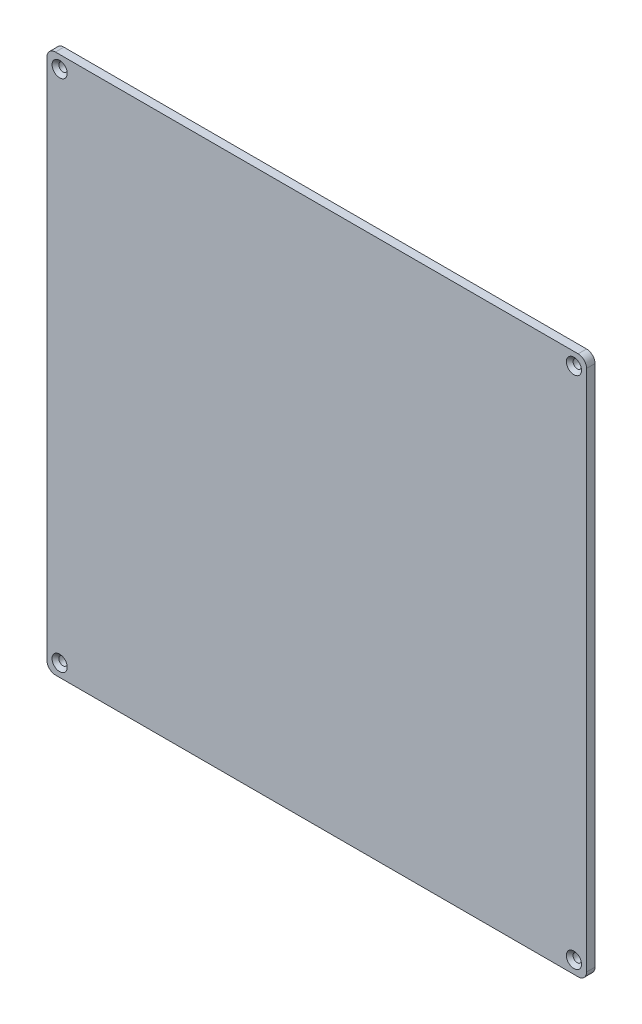
ISO-10303-21;
HEADER;
FILE_DESCRIPTION(('STEP AP214'),'2;1');
FILE_NAME('part.step','',(''),(''),'','','');
FILE_SCHEMA(('AUTOMOTIVE_DESIGN { 1 0 10303 214 1 1 1 1 }'));
ENDSEC;
DATA;
#1=APPLICATION_CONTEXT('core data for automotive mechanical design processes');
#2=APPLICATION_PROTOCOL_DEFINITION('international standard','automotive_design',2000,#1);
#3=PRODUCT_CONTEXT('',#1,'mechanical');
#4=PRODUCT('Part','Part','',(#3));
#5=PRODUCT_RELATED_PRODUCT_CATEGORY('part','',(#4));
#6=PRODUCT_DEFINITION_FORMATION('','',#4);
#7=PRODUCT_DEFINITION_CONTEXT('part definition',#1,'design');
#8=PRODUCT_DEFINITION('design','',#6,#7);
#9=PRODUCT_DEFINITION_SHAPE('','',#8);
#10=(LENGTH_UNIT() NAMED_UNIT(*) SI_UNIT(.MILLI.,.METRE.));
#11=(NAMED_UNIT(*) PLANE_ANGLE_UNIT() SI_UNIT($,.RADIAN.));
#12=(NAMED_UNIT(*) SI_UNIT($,.STERADIAN.) SOLID_ANGLE_UNIT());
#13=UNCERTAINTY_MEASURE_WITH_UNIT(LENGTH_MEASURE(1.E-05),#10,'distance_accuracy_value','');
#14=(GEOMETRIC_REPRESENTATION_CONTEXT(3) GLOBAL_UNCERTAINTY_ASSIGNED_CONTEXT((#13)) GLOBAL_UNIT_ASSIGNED_CONTEXT((#10,
#11,#12)) REPRESENTATION_CONTEXT('',''));
#15=CARTESIAN_POINT('',(0.,0.,0.));
#16=DIRECTION('',(0.,0.,1.));
#17=DIRECTION('',(1.,0.,0.));
#18=AXIS2_PLACEMENT_3D('',#15,#16,#17);
#19=CARTESIAN_POINT('',(0.,0.,5.));
#20=DIRECTION('',(0.,1.,0.));
#21=DIRECTION('',(0.,0.,1.));
#22=AXIS2_PLACEMENT_3D('',#19,#20,#21);
#23=PLANE('',#22);
#24=DIRECTION('',(1.,0.,0.));
#25=VECTOR('',#24,1.);
#26=CARTESIAN_POINT('',(0.,0.,5.));
#27=LINE('',#26,#25);
#28=CARTESIAN_POINT('',(5.,0.,5.));
#29=VERTEX_POINT('',#28);
#30=CARTESIAN_POINT('',(315.,0.,5.));
#31=VERTEX_POINT('',#30);
#32=EDGE_CURVE('E121',#29,#31,#27,.T.);
#33=ORIENTED_EDGE('',*,*,#32,.F.);
#34=DIRECTION('',(0.,0.,-1.));
#35=VECTOR('',#34,1.);
#36=CARTESIAN_POINT('',(5.,0.,0.));
#37=LINE('',#36,#35);
#38=CARTESIAN_POINT('',(5.,0.,0.));
#39=VERTEX_POINT('',#38);
#40=EDGE_CURVE('E106',#29,#39,#37,.T.);
#41=ORIENTED_EDGE('',*,*,#40,.T.);
#42=DIRECTION('',(1.,0.,0.));
#43=VECTOR('',#42,1.);
#44=CARTESIAN_POINT('',(0.,0.,0.));
#45=LINE('',#44,#43);
#46=CARTESIAN_POINT('',(315.,0.,0.));
#47=VERTEX_POINT('',#46);
#48=EDGE_CURVE('E118',#39,#47,#45,.T.);
#49=ORIENTED_EDGE('',*,*,#48,.T.);
#50=DIRECTION('',(0.,0.,-1.));
#51=VECTOR('',#50,1.);
#52=CARTESIAN_POINT('',(315.,0.,5.));
#53=LINE('',#52,#51);
#54=EDGE_CURVE('E123',#47,#31,#53,.F.);
#55=ORIENTED_EDGE('',*,*,#54,.T.);
#56=EDGE_LOOP('',(#33,#41,#49,#55));
#57=FACE_BOUND('',#56,.T.);
#58=ADVANCED_FACE('F35',(#57),#23,.F.);
#59=CARTESIAN_POINT('',(320.,0.,5.));
#60=DIRECTION('',(-1.,0.,0.));
#61=DIRECTION('',(0.,0.,1.));
#62=AXIS2_PLACEMENT_3D('',#59,#60,#61);
#63=PLANE('',#62);
#64=DIRECTION('',(0.,1.,0.));
#65=VECTOR('',#64,1.);
#66=CARTESIAN_POINT('',(320.,0.,5.));
#67=LINE('',#66,#65);
#68=CARTESIAN_POINT('',(320.,5.,5.));
#69=VERTEX_POINT('',#68);
#70=CARTESIAN_POINT('',(320.,315.,5.));
#71=VERTEX_POINT('',#70);
#72=EDGE_CURVE('E278',#69,#71,#67,.T.);
#73=ORIENTED_EDGE('',*,*,#72,.F.);
#74=DIRECTION('',(0.,0.,-1.));
#75=VECTOR('',#74,1.);
#76=CARTESIAN_POINT('',(320.,5.,5.));
#77=LINE('',#76,#75);
#78=CARTESIAN_POINT('',(320.,5.,0.));
#79=VERTEX_POINT('',#78);
#80=EDGE_CURVE('E164',#69,#79,#77,.T.);
#81=ORIENTED_EDGE('',*,*,#80,.T.);
#82=DIRECTION('',(0.,1.,0.));
#83=VECTOR('',#82,1.);
#84=CARTESIAN_POINT('',(320.,0.,0.));
#85=LINE('',#84,#83);
#86=CARTESIAN_POINT('',(320.,315.,0.));
#87=VERTEX_POINT('',#86);
#88=EDGE_CURVE('E128',#79,#87,#85,.T.);
#89=ORIENTED_EDGE('',*,*,#88,.T.);
#90=DIRECTION('',(0.,0.,-1.));
#91=VECTOR('',#90,1.);
#92=CARTESIAN_POINT('',(320.,315.,5.));
#93=LINE('',#92,#91);
#94=EDGE_CURVE('E162',#87,#71,#93,.F.);
#95=ORIENTED_EDGE('',*,*,#94,.T.);
#96=EDGE_LOOP('',(#73,#81,#89,#95));
#97=FACE_BOUND('',#96,.T.);
#98=ADVANCED_FACE('F208',(#97),#63,.F.);
#99=CARTESIAN_POINT('',(0.,320.,5.));
#100=DIRECTION('',(0.,1.,0.));
#101=DIRECTION('',(0.,0.,1.));
#102=AXIS2_PLACEMENT_3D('',#99,#100,#101);
#103=PLANE('',#102);
#104=DIRECTION('',(1.,0.,0.));
#105=VECTOR('',#104,1.);
#106=CARTESIAN_POINT('',(0.,320.,5.));
#107=LINE('',#106,#105);
#108=CARTESIAN_POINT('',(5.,320.,5.));
#109=VERTEX_POINT('',#108);
#110=CARTESIAN_POINT('',(315.,320.,5.));
#111=VERTEX_POINT('',#110);
#112=EDGE_CURVE('E275',#109,#111,#107,.T.);
#113=ORIENTED_EDGE('',*,*,#112,.T.);
#114=DIRECTION('',(0.,0.,-1.));
#115=VECTOR('',#114,1.);
#116=CARTESIAN_POINT('',(315.,320.,0.));
#117=LINE('',#116,#115);
#118=CARTESIAN_POINT('',(315.,320.,0.));
#119=VERTEX_POINT('',#118);
#120=EDGE_CURVE('E168',#111,#119,#117,.T.);
#121=ORIENTED_EDGE('',*,*,#120,.T.);
#122=DIRECTION('',(1.,0.,0.));
#123=VECTOR('',#122,1.);
#124=CARTESIAN_POINT('',(0.,320.,0.));
#125=LINE('',#124,#123);
#126=CARTESIAN_POINT('',(5.,320.,0.));
#127=VERTEX_POINT('',#126);
#128=EDGE_CURVE('E132',#127,#119,#125,.T.);
#129=ORIENTED_EDGE('',*,*,#128,.F.);
#130=DIRECTION('',(0.,0.,-1.));
#131=VECTOR('',#130,1.);
#132=CARTESIAN_POINT('',(5.,320.,5.));
#133=LINE('',#132,#131);
#134=EDGE_CURVE('E57',#127,#109,#133,.F.);
#135=ORIENTED_EDGE('',*,*,#134,.T.);
#136=EDGE_LOOP('',(#113,#121,#129,#135));
#137=FACE_BOUND('',#136,.T.);
#138=ADVANCED_FACE('F213',(#137),#103,.T.);
#139=CARTESIAN_POINT('',(0.,0.,5.));
#140=DIRECTION('',(-1.,0.,0.));
#141=DIRECTION('',(0.,0.,1.));
#142=AXIS2_PLACEMENT_3D('',#139,#140,#141);
#143=PLANE('',#142);
#144=DIRECTION('',(0.,1.,0.));
#145=VECTOR('',#144,1.);
#146=CARTESIAN_POINT('',(0.,0.,0.));
#147=LINE('',#146,#145);
#148=CARTESIAN_POINT('',(0.,5.,0.));
#149=VERTEX_POINT('',#148);
#150=CARTESIAN_POINT('',(0.,315.,0.));
#151=VERTEX_POINT('',#150);
#152=EDGE_CURVE('E141',#149,#151,#147,.T.);
#153=ORIENTED_EDGE('',*,*,#152,.F.);
#154=DIRECTION('',(0.,0.,-1.));
#155=VECTOR('',#154,1.);
#156=CARTESIAN_POINT('',(0.,5.,5.));
#157=LINE('',#156,#155);
#158=CARTESIAN_POINT('',(0.,5.,5.));
#159=VERTEX_POINT('',#158);
#160=EDGE_CURVE('E107',#149,#159,#157,.F.);
#161=ORIENTED_EDGE('',*,*,#160,.T.);
#162=DIRECTION('',(0.,1.,0.));
#163=VECTOR('',#162,1.);
#164=CARTESIAN_POINT('',(0.,0.,5.));
#165=LINE('',#164,#163);
#166=CARTESIAN_POINT('',(0.,315.,5.));
#167=VERTEX_POINT('',#166);
#168=EDGE_CURVE('E146',#159,#167,#165,.T.);
#169=ORIENTED_EDGE('',*,*,#168,.T.);
#170=DIRECTION('',(0.,0.,-1.));
#171=VECTOR('',#170,1.);
#172=CARTESIAN_POINT('',(0.,315.,5.));
#173=LINE('',#172,#171);
#174=EDGE_CURVE('E112',#167,#151,#173,.T.);
#175=ORIENTED_EDGE('',*,*,#174,.T.);
#176=EDGE_LOOP('',(#153,#161,#169,#175));
#177=FACE_BOUND('',#176,.T.);
#178=ADVANCED_FACE('F222',(#177),#143,.T.);
#179=CARTESIAN_POINT('',(7.5,312.5,5.));
#180=DIRECTION('',(0.,0.,-1.));
#181=DIRECTION('',(-1.,0.,0.));
#182=AXIS2_PLACEMENT_3D('',#179,#180,#181);
#183=CYLINDRICAL_SURFACE('',#182,2.5);
#184=CARTESIAN_POINT('',(7.5,312.5,2.99999999999999));
#185=DIRECTION('',(0.,0.,1.));
#186=DIRECTION('',(1.,0.,0.));
#187=AXIS2_PLACEMENT_3D('',#184,#185,#186);
#188=CIRCLE('',#187,2.5);
#189=CARTESIAN_POINT('',(10.,312.5,2.99999999999999));
#190=VERTEX_POINT('',#189);
#191=EDGE_CURVE('E171',#190,#190,#188,.T.);
#192=ORIENTED_EDGE('',*,*,#191,.T.);
#193=EDGE_LOOP('',(#192));
#194=FACE_BOUND('',#193,.T.);
#195=CARTESIAN_POINT('',(7.5,312.5,0.));
#196=DIRECTION('',(0.,0.,1.));
#197=DIRECTION('',(1.,0.,0.));
#198=AXIS2_PLACEMENT_3D('',#195,#196,#197);
#199=CIRCLE('',#198,2.5);
#200=CARTESIAN_POINT('',(10.,312.5,0.));
#201=VERTEX_POINT('',#200);
#202=EDGE_CURVE('E129',#201,#201,#199,.T.);
#203=ORIENTED_EDGE('',*,*,#202,.F.);
#204=EDGE_LOOP('',(#203));
#205=FACE_BOUND('',#204,.T.);
#206=ADVANCED_FACE('F218',(#194,#205),#183,.F.);
#207=CARTESIAN_POINT('',(312.5,312.5,5.));
#208=DIRECTION('',(0.,0.,-1.));
#209=DIRECTION('',(-1.,0.,0.));
#210=AXIS2_PLACEMENT_3D('',#207,#208,#209);
#211=CYLINDRICAL_SURFACE('',#210,2.50000000000002);
#212=CARTESIAN_POINT('',(312.5,312.5,2.99999999999995));
#213=DIRECTION('',(0.,0.,1.));
#214=DIRECTION('',(1.,0.,0.));
#215=AXIS2_PLACEMENT_3D('',#212,#213,#214);
#216=CIRCLE('',#215,2.50000000000002);
#217=CARTESIAN_POINT('',(315.,312.5,2.99999999999995));
#218=VERTEX_POINT('',#217);
#219=EDGE_CURVE('E11',#218,#218,#216,.T.);
#220=ORIENTED_EDGE('',*,*,#219,.T.);
#221=EDGE_LOOP('',(#220));
#222=FACE_BOUND('',#221,.T.);
#223=CARTESIAN_POINT('',(312.5,312.5,0.));
#224=DIRECTION('',(0.,0.,1.));
#225=DIRECTION('',(1.,0.,0.));
#226=AXIS2_PLACEMENT_3D('',#223,#224,#225);
#227=CIRCLE('',#226,2.50000000000002);
#228=CARTESIAN_POINT('',(315.,312.5,0.));
#229=VERTEX_POINT('',#228);
#230=EDGE_CURVE('E135',#229,#229,#227,.F.);
#231=ORIENTED_EDGE('',*,*,#230,.T.);
#232=EDGE_LOOP('',(#231));
#233=FACE_BOUND('',#232,.T.);
#234=ADVANCED_FACE('F221',(#222,#233),#211,.F.);
#235=CARTESIAN_POINT('',(312.5,7.50000000000001,5.));
#236=DIRECTION('',(0.,0.,-1.));
#237=DIRECTION('',(-1.,0.,0.));
#238=AXIS2_PLACEMENT_3D('',#235,#236,#237);
#239=CYLINDRICAL_SURFACE('',#238,2.50000000000002);
#240=CARTESIAN_POINT('',(312.5,7.50000000000001,3.00000000000007));
#241=DIRECTION('',(0.,0.,1.));
#242=DIRECTION('',(1.,0.,0.));
#243=AXIS2_PLACEMENT_3D('',#240,#241,#242);
#244=CIRCLE('',#243,2.50000000000002);
#245=CARTESIAN_POINT('',(315.,7.50000000000001,3.00000000000007));
#246=VERTEX_POINT('',#245);
#247=EDGE_CURVE('E43',#246,#246,#244,.T.);
#248=ORIENTED_EDGE('',*,*,#247,.T.);
#249=EDGE_LOOP('',(#248));
#250=FACE_BOUND('',#249,.T.);
#251=CARTESIAN_POINT('',(312.5,7.50000000000001,0.));
#252=DIRECTION('',(0.,0.,1.));
#253=DIRECTION('',(1.,0.,0.));
#254=AXIS2_PLACEMENT_3D('',#251,#252,#253);
#255=CIRCLE('',#254,2.50000000000002);
#256=CARTESIAN_POINT('',(315.,7.50000000000001,0.));
#257=VERTEX_POINT('',#256);
#258=EDGE_CURVE('E290',#257,#257,#255,.T.);
#259=ORIENTED_EDGE('',*,*,#258,.F.);
#260=EDGE_LOOP('',(#259));
#261=FACE_BOUND('',#260,.T.);
#262=ADVANCED_FACE('F191',(#250,#261),#239,.F.);
#263=CARTESIAN_POINT('',(7.5,7.50000000000001,5.));
#264=DIRECTION('',(0.,0.,-1.));
#265=DIRECTION('',(-1.,0.,0.));
#266=AXIS2_PLACEMENT_3D('',#263,#264,#265);
#267=CYLINDRICAL_SURFACE('',#266,2.5);
#268=CARTESIAN_POINT('',(7.5,7.50000000000001,3.00000000000006));
#269=DIRECTION('',(0.,0.,1.));
#270=DIRECTION('',(1.,0.,0.));
#271=AXIS2_PLACEMENT_3D('',#268,#269,#270);
#272=CIRCLE('',#271,2.5);
#273=CARTESIAN_POINT('',(10.,7.50000000000001,3.00000000000006));
#274=VERTEX_POINT('',#273);
#275=EDGE_CURVE('E186',#274,#274,#272,.T.);
#276=ORIENTED_EDGE('',*,*,#275,.T.);
#277=EDGE_LOOP('',(#276));
#278=FACE_BOUND('',#277,.T.);
#279=CARTESIAN_POINT('',(7.5,7.50000000000001,0.));
#280=DIRECTION('',(0.,0.,1.));
#281=DIRECTION('',(1.,0.,0.));
#282=AXIS2_PLACEMENT_3D('',#279,#280,#281);
#283=CIRCLE('',#282,2.5);
#284=CARTESIAN_POINT('',(10.,7.50000000000001,0.));
#285=VERTEX_POINT('',#284);
#286=EDGE_CURVE('E143',#285,#285,#283,.F.);
#287=ORIENTED_EDGE('',*,*,#286,.T.);
#288=EDGE_LOOP('',(#287));
#289=FACE_BOUND('',#288,.T.);
#290=ADVANCED_FACE('F229',(#278,#289),#267,.F.);
#291=CARTESIAN_POINT('',(0.,0.,5.));
#292=DIRECTION('',(0.,0.,1.));
#293=DIRECTION('',(1.,0.,0.));
#294=AXIS2_PLACEMENT_3D('',#291,#292,#293);
#295=PLANE('',#294);
#296=CARTESIAN_POINT('',(7.5,312.5,5.));
#297=DIRECTION('',(0.,0.,1.));
#298=DIRECTION('',(1.,0.,0.));
#299=AXIS2_PLACEMENT_3D('',#296,#297,#298);
#300=CIRCLE('',#299,4.50000000000006);
#301=CARTESIAN_POINT('',(12.0000000000001,312.5,5.));
#302=VERTEX_POINT('',#301);
#303=EDGE_CURVE('E183',#302,#302,#300,.F.);
#304=ORIENTED_EDGE('',*,*,#303,.T.);
#305=EDGE_LOOP('',(#304));
#306=FACE_BOUND('',#305,.T.);
#307=CARTESIAN_POINT('',(7.5,7.50000000000001,5.));
#308=DIRECTION('',(0.,0.,1.));
#309=DIRECTION('',(1.,0.,0.));
#310=AXIS2_PLACEMENT_3D('',#307,#308,#309);
#311=CIRCLE('',#310,4.49999999999995);
#312=CARTESIAN_POINT('',(11.9999999999999,7.50000000000001,5.));
#313=VERTEX_POINT('',#312);
#314=EDGE_CURVE('E180',#313,#313,#311,.F.);
#315=ORIENTED_EDGE('',*,*,#314,.T.);
#316=EDGE_LOOP('',(#315));
#317=FACE_BOUND('',#316,.T.);
#318=CARTESIAN_POINT('',(312.5,7.50000000000001,5.));
#319=DIRECTION('',(0.,0.,1.));
#320=DIRECTION('',(1.,0.,0.));
#321=AXIS2_PLACEMENT_3D('',#318,#319,#320);
#322=CIRCLE('',#321,4.49999999999995);
#323=CARTESIAN_POINT('',(317.,7.50000000000001,5.));
#324=VERTEX_POINT('',#323);
#325=EDGE_CURVE('E177',#324,#324,#322,.F.);
#326=ORIENTED_EDGE('',*,*,#325,.T.);
#327=EDGE_LOOP('',(#326));
#328=FACE_BOUND('',#327,.T.);
#329=CARTESIAN_POINT('',(312.5,312.5,5.));
#330=DIRECTION('',(0.,0.,1.));
#331=DIRECTION('',(1.,0.,0.));
#332=AXIS2_PLACEMENT_3D('',#329,#330,#331);
#333=CIRCLE('',#332,4.50000000000006);
#334=CARTESIAN_POINT('',(317.,312.5,5.));
#335=VERTEX_POINT('',#334);
#336=EDGE_CURVE('E174',#335,#335,#333,.F.);
#337=ORIENTED_EDGE('',*,*,#336,.T.);
#338=EDGE_LOOP('',(#337));
#339=FACE_BOUND('',#338,.T.);
#340=ORIENTED_EDGE('',*,*,#168,.F.);
#341=CARTESIAN_POINT('',(5.,5.,5.));
#342=DIRECTION('',(0.,0.,1.));
#343=DIRECTION('',(1.,0.,0.));
#344=AXIS2_PLACEMENT_3D('',#341,#342,#343);
#345=CIRCLE('',#344,5.);
#346=EDGE_CURVE('E160',#159,#29,#345,.T.);
#347=ORIENTED_EDGE('',*,*,#346,.T.);
#348=ORIENTED_EDGE('',*,*,#32,.T.);
#349=CARTESIAN_POINT('',(315.,5.,5.));
#350=DIRECTION('',(0.,0.,1.));
#351=DIRECTION('',(1.,0.,0.));
#352=AXIS2_PLACEMENT_3D('',#349,#350,#351);
#353=CIRCLE('',#352,5.);
#354=EDGE_CURVE('E158',#31,#69,#353,.T.);
#355=ORIENTED_EDGE('',*,*,#354,.T.);
#356=ORIENTED_EDGE('',*,*,#72,.T.);
#357=CARTESIAN_POINT('',(315.,315.,5.));
#358=DIRECTION('',(0.,0.,1.));
#359=DIRECTION('',(1.,0.,0.));
#360=AXIS2_PLACEMENT_3D('',#357,#358,#359);
#361=CIRCLE('',#360,5.);
#362=EDGE_CURVE('E50',#71,#111,#361,.T.);
#363=ORIENTED_EDGE('',*,*,#362,.T.);
#364=ORIENTED_EDGE('',*,*,#112,.F.);
#365=CARTESIAN_POINT('',(5.,315.,5.));
#366=DIRECTION('',(0.,0.,1.));
#367=DIRECTION('',(1.,0.,0.));
#368=AXIS2_PLACEMENT_3D('',#365,#366,#367);
#369=CIRCLE('',#368,5.);
#370=EDGE_CURVE('E155',#109,#167,#369,.T.);
#371=ORIENTED_EDGE('',*,*,#370,.T.);
#372=EDGE_LOOP('',(#340,#347,#348,#355,#356,#363,#364,#371));
#373=FACE_BOUND('',#372,.T.);
#374=ADVANCED_FACE('F255',(#306,#317,#328,#339,#373),#295,.T.);
#375=CARTESIAN_POINT('',(0.,0.,0.));
#376=DIRECTION('',(0.,0.,1.));
#377=DIRECTION('',(1.,0.,0.));
#378=AXIS2_PLACEMENT_3D('',#375,#376,#377);
#379=PLANE('',#378);
#380=ORIENTED_EDGE('',*,*,#258,.T.);
#381=EDGE_LOOP('',(#380));
#382=FACE_BOUND('',#381,.T.);
#383=ORIENTED_EDGE('',*,*,#230,.F.);
#384=EDGE_LOOP('',(#383));
#385=FACE_BOUND('',#384,.T.);
#386=ORIENTED_EDGE('',*,*,#202,.T.);
#387=EDGE_LOOP('',(#386));
#388=FACE_BOUND('',#387,.T.);
#389=ORIENTED_EDGE('',*,*,#48,.F.);
#390=CARTESIAN_POINT('',(5.,5.,0.));
#391=DIRECTION('',(0.,0.,1.));
#392=DIRECTION('',(1.,0.,0.));
#393=AXIS2_PLACEMENT_3D('',#390,#391,#392);
#394=CIRCLE('',#393,5.);
#395=EDGE_CURVE('E102',#39,#149,#394,.F.);
#396=ORIENTED_EDGE('',*,*,#395,.T.);
#397=ORIENTED_EDGE('',*,*,#152,.T.);
#398=CARTESIAN_POINT('',(5.,315.,0.));
#399=DIRECTION('',(0.,0.,1.));
#400=DIRECTION('',(1.,0.,0.));
#401=AXIS2_PLACEMENT_3D('',#398,#399,#400);
#402=CIRCLE('',#401,5.);
#403=EDGE_CURVE('E122',#151,#127,#402,.F.);
#404=ORIENTED_EDGE('',*,*,#403,.T.);
#405=ORIENTED_EDGE('',*,*,#128,.T.);
#406=CARTESIAN_POINT('',(315.,315.,0.));
#407=DIRECTION('',(0.,0.,1.));
#408=DIRECTION('',(1.,0.,0.));
#409=AXIS2_PLACEMENT_3D('',#406,#407,#408);
#410=CIRCLE('',#409,5.);
#411=EDGE_CURVE('E149',#119,#87,#410,.F.);
#412=ORIENTED_EDGE('',*,*,#411,.T.);
#413=ORIENTED_EDGE('',*,*,#88,.F.);
#414=CARTESIAN_POINT('',(315.,5.,0.));
#415=DIRECTION('',(0.,0.,1.));
#416=DIRECTION('',(1.,0.,0.));
#417=AXIS2_PLACEMENT_3D('',#414,#415,#416);
#418=CIRCLE('',#417,5.);
#419=EDGE_CURVE('E113',#79,#47,#418,.F.);
#420=ORIENTED_EDGE('',*,*,#419,.T.);
#421=EDGE_LOOP('',(#389,#396,#397,#404,#405,#412,#413,#420));
#422=FACE_BOUND('',#421,.T.);
#423=ORIENTED_EDGE('',*,*,#286,.F.);
#424=EDGE_LOOP('',(#423));
#425=FACE_BOUND('',#424,.T.);
#426=ADVANCED_FACE('F125',(#382,#385,#388,#422,#425),#379,.F.);
#427=CARTESIAN_POINT('',(5.,5.,5.));
#428=DIRECTION('',(0.,0.,1.));
#429=DIRECTION('',(1.,0.,0.));
#430=AXIS2_PLACEMENT_3D('',#427,#428,#429);
#431=CYLINDRICAL_SURFACE('',#430,5.);
#432=ORIENTED_EDGE('',*,*,#346,.F.);
#433=ORIENTED_EDGE('',*,*,#160,.F.);
#434=ORIENTED_EDGE('',*,*,#395,.F.);
#435=ORIENTED_EDGE('',*,*,#40,.F.);
#436=EDGE_LOOP('',(#432,#433,#434,#435));
#437=FACE_BOUND('',#436,.T.);
#438=ADVANCED_FACE('F105',(#437),#431,.T.);
#439=CARTESIAN_POINT('',(315.,5.,5.));
#440=DIRECTION('',(0.,0.,-1.));
#441=DIRECTION('',(-1.,0.,0.));
#442=AXIS2_PLACEMENT_3D('',#439,#440,#441);
#443=CYLINDRICAL_SURFACE('',#442,5.);
#444=ORIENTED_EDGE('',*,*,#354,.F.);
#445=ORIENTED_EDGE('',*,*,#54,.F.);
#446=ORIENTED_EDGE('',*,*,#419,.F.);
#447=ORIENTED_EDGE('',*,*,#80,.F.);
#448=EDGE_LOOP('',(#444,#445,#446,#447));
#449=FACE_BOUND('',#448,.T.);
#450=ADVANCED_FACE('F232',(#449),#443,.T.);
#451=CARTESIAN_POINT('',(315.,315.,5.));
#452=DIRECTION('',(0.,0.,1.));
#453=DIRECTION('',(1.,0.,0.));
#454=AXIS2_PLACEMENT_3D('',#451,#452,#453);
#455=CYLINDRICAL_SURFACE('',#454,5.);
#456=ORIENTED_EDGE('',*,*,#362,.F.);
#457=ORIENTED_EDGE('',*,*,#94,.F.);
#458=ORIENTED_EDGE('',*,*,#411,.F.);
#459=ORIENTED_EDGE('',*,*,#120,.F.);
#460=EDGE_LOOP('',(#456,#457,#458,#459));
#461=FACE_BOUND('',#460,.T.);
#462=ADVANCED_FACE('F235',(#461),#455,.T.);
#463=CARTESIAN_POINT('',(5.,315.,5.));
#464=DIRECTION('',(0.,0.,-1.));
#465=DIRECTION('',(-1.,0.,0.));
#466=AXIS2_PLACEMENT_3D('',#463,#464,#465);
#467=CYLINDRICAL_SURFACE('',#466,5.);
#468=ORIENTED_EDGE('',*,*,#370,.F.);
#469=ORIENTED_EDGE('',*,*,#134,.F.);
#470=ORIENTED_EDGE('',*,*,#403,.F.);
#471=ORIENTED_EDGE('',*,*,#174,.F.);
#472=EDGE_LOOP('',(#468,#469,#470,#471));
#473=FACE_BOUND('',#472,.T.);
#474=ADVANCED_FACE('F239',(#473),#467,.T.);
#475=CARTESIAN_POINT('',(7.5,312.5,2.99999999999999));
#476=DIRECTION('',(0.,0.,1.));
#477=DIRECTION('',(1.,0.,0.));
#478=AXIS2_PLACEMENT_3D('',#475,#476,#477);
#479=CONICAL_SURFACE('',#478,2.5,0.78539816339746);
#480=ORIENTED_EDGE('',*,*,#303,.F.);
#481=EDGE_LOOP('',(#480));
#482=FACE_BOUND('',#481,.T.);
#483=ORIENTED_EDGE('',*,*,#191,.F.);
#484=EDGE_LOOP('',(#483));
#485=FACE_BOUND('',#484,.T.);
#486=ADVANCED_FACE('F203',(#482,#485),#479,.F.);
#487=CARTESIAN_POINT('',(7.5,7.50000000000001,5.));
#488=DIRECTION('',(0.,0.,1.));
#489=DIRECTION('',(1.,0.,0.));
#490=AXIS2_PLACEMENT_3D('',#487,#488,#489);
#491=CONICAL_SURFACE('',#490,4.49999999999995,0.785398163397451);
#492=ORIENTED_EDGE('',*,*,#275,.F.);
#493=EDGE_LOOP('',(#492));
#494=FACE_BOUND('',#493,.T.);
#495=ORIENTED_EDGE('',*,*,#314,.F.);
#496=EDGE_LOOP('',(#495));
#497=FACE_BOUND('',#496,.T.);
#498=ADVANCED_FACE('F196',(#494,#497),#491,.F.);
#499=CARTESIAN_POINT('',(312.5,7.50000000000001,3.00000000000007));
#500=DIRECTION('',(0.,0.,1.));
#501=DIRECTION('',(1.,0.,0.));
#502=AXIS2_PLACEMENT_3D('',#499,#500,#501);
#503=CONICAL_SURFACE('',#502,2.50000000000002,0.785398163397446);
#504=ORIENTED_EDGE('',*,*,#325,.F.);
#505=EDGE_LOOP('',(#504));
#506=FACE_BOUND('',#505,.T.);
#507=ORIENTED_EDGE('',*,*,#247,.F.);
#508=EDGE_LOOP('',(#507));
#509=FACE_BOUND('',#508,.T.);
#510=ADVANCED_FACE('F194',(#506,#509),#503,.F.);
#511=CARTESIAN_POINT('',(312.5,312.5,5.));
#512=DIRECTION('',(0.,0.,1.));
#513=DIRECTION('',(1.,0.,0.));
#514=AXIS2_PLACEMENT_3D('',#511,#512,#513);
#515=CONICAL_SURFACE('',#514,4.50000000000006,0.785398163397446);
#516=ORIENTED_EDGE('',*,*,#219,.F.);
#517=EDGE_LOOP('',(#516));
#518=FACE_BOUND('',#517,.T.);
#519=ORIENTED_EDGE('',*,*,#336,.F.);
#520=EDGE_LOOP('',(#519));
#521=FACE_BOUND('',#520,.T.);
#522=ADVANCED_FACE('F37',(#518,#521),#515,.F.);
#523=CLOSED_SHELL('',(#58,#98,#138,#178,#206,#234,#262,#290,#374,#426,#438,#450,#462,#474,#486,
#498,#510,#522));
#524=MANIFOLD_SOLID_BREP('B2',#523);
#525=ADVANCED_BREP_SHAPE_REPRESENTATION('',(#18,#524),#14);
#526=SHAPE_DEFINITION_REPRESENTATION(#9,#525);
ENDSEC;
END-ISO-10303-21;
